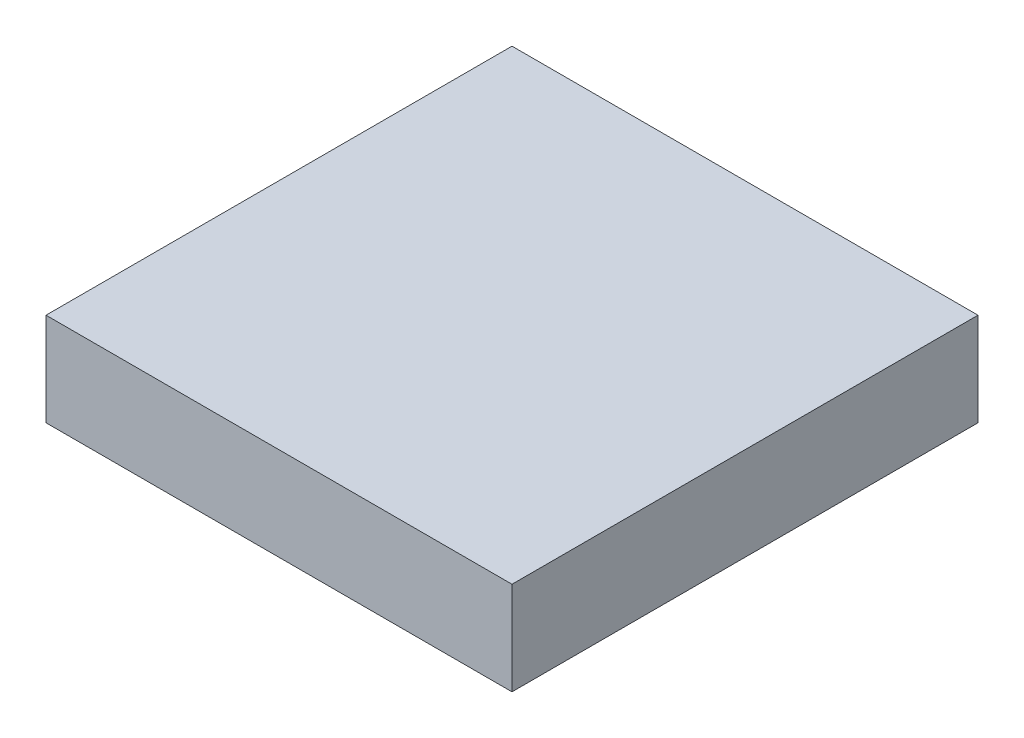
ISO-10303-21;
HEADER;
FILE_DESCRIPTION(('STEP AP214'),'2;1');
FILE_NAME('part.step','',(''),(''),'','','');
FILE_SCHEMA(('AUTOMOTIVE_DESIGN { 1 0 10303 214 1 1 1 1 }'));
ENDSEC;
DATA;
#1=APPLICATION_CONTEXT('core data for automotive mechanical design processes');
#2=APPLICATION_PROTOCOL_DEFINITION('international standard','automotive_design',2000,#1);
#3=PRODUCT_CONTEXT('',#1,'mechanical');
#4=PRODUCT('Part','Part','',(#3));
#5=PRODUCT_RELATED_PRODUCT_CATEGORY('part','',(#4));
#6=PRODUCT_DEFINITION_FORMATION('','',#4);
#7=PRODUCT_DEFINITION_CONTEXT('part definition',#1,'design');
#8=PRODUCT_DEFINITION('design','',#6,#7);
#9=PRODUCT_DEFINITION_SHAPE('','',#8);
#10=(LENGTH_UNIT() NAMED_UNIT(*) SI_UNIT(.MILLI.,.METRE.));
#11=(NAMED_UNIT(*) PLANE_ANGLE_UNIT() SI_UNIT($,.RADIAN.));
#12=(NAMED_UNIT(*) SI_UNIT($,.STERADIAN.) SOLID_ANGLE_UNIT());
#13=UNCERTAINTY_MEASURE_WITH_UNIT(LENGTH_MEASURE(1.E-05),#10,'distance_accuracy_value','');
#14=(GEOMETRIC_REPRESENTATION_CONTEXT(3) GLOBAL_UNCERTAINTY_ASSIGNED_CONTEXT((#13)) GLOBAL_UNIT_ASSIGNED_CONTEXT((#10,
#11,#12)) REPRESENTATION_CONTEXT('',''));
#15=CARTESIAN_POINT('',(0.,0.,0.));
#16=DIRECTION('',(0.,0.,1.));
#17=DIRECTION('',(1.,0.,0.));
#18=AXIS2_PLACEMENT_3D('',#15,#16,#17);
#19=CARTESIAN_POINT('',(-1.,0.4,-1.));
#20=DIRECTION('',(1.,0.,0.));
#21=DIRECTION('',(0.,0.,-1.));
#22=AXIS2_PLACEMENT_3D('',#19,#20,#21);
#23=PLANE('',#22);
#24=DIRECTION('',(0.,0.,1.));
#25=VECTOR('',#24,1.);
#26=CARTESIAN_POINT('',(-1.,0.,-1.));
#27=LINE('',#26,#25);
#28=CARTESIAN_POINT('',(-1.,0.,-1.));
#29=VERTEX_POINT('',#28);
#30=CARTESIAN_POINT('',(-1.,0.,1.));
#31=VERTEX_POINT('',#30);
#32=EDGE_CURVE('E99',#29,#31,#27,.T.);
#33=ORIENTED_EDGE('',*,*,#32,.T.);
#34=DIRECTION('',(0.,-1.,0.));
#35=VECTOR('',#34,1.);
#36=CARTESIAN_POINT('',(-1.,0.4,1.));
#37=LINE('',#36,#35);
#38=CARTESIAN_POINT('',(-1.,0.4,1.));
#39=VERTEX_POINT('',#38);
#40=EDGE_CURVE('E11',#39,#31,#37,.T.);
#41=ORIENTED_EDGE('',*,*,#40,.F.);
#42=DIRECTION('',(0.,0.,1.));
#43=VECTOR('',#42,1.);
#44=CARTESIAN_POINT('',(-1.,0.4,-1.));
#45=LINE('',#44,#43);
#46=CARTESIAN_POINT('',(-1.,0.4,-1.));
#47=VERTEX_POINT('',#46);
#48=EDGE_CURVE('E87',#47,#39,#45,.T.);
#49=ORIENTED_EDGE('',*,*,#48,.F.);
#50=DIRECTION('',(0.,-1.,0.));
#51=VECTOR('',#50,1.);
#52=CARTESIAN_POINT('',(-1.,0.4,-1.));
#53=LINE('',#52,#51);
#54=EDGE_CURVE('E95',#47,#29,#53,.T.);
#55=ORIENTED_EDGE('',*,*,#54,.T.);
#56=EDGE_LOOP('',(#33,#41,#49,#55));
#57=FACE_BOUND('',#56,.T.);
#58=ADVANCED_FACE('F36',(#57),#23,.F.);
#59=CARTESIAN_POINT('',(-1.,0.4,1.));
#60=DIRECTION('',(0.,0.,-1.));
#61=DIRECTION('',(-1.,0.,0.));
#62=AXIS2_PLACEMENT_3D('',#59,#60,#61);
#63=PLANE('',#62);
#64=DIRECTION('',(1.,0.,0.));
#65=VECTOR('',#64,1.);
#66=CARTESIAN_POINT('',(-1.,0.,1.));
#67=LINE('',#66,#65);
#68=CARTESIAN_POINT('',(1.,0.,1.));
#69=VERTEX_POINT('',#68);
#70=EDGE_CURVE('E91',#31,#69,#67,.T.);
#71=ORIENTED_EDGE('',*,*,#70,.T.);
#72=DIRECTION('',(0.,-1.,0.));
#73=VECTOR('',#72,1.);
#74=CARTESIAN_POINT('',(1.,0.4,1.));
#75=LINE('',#74,#73);
#76=CARTESIAN_POINT('',(1.,0.4,1.));
#77=VERTEX_POINT('',#76);
#78=EDGE_CURVE('E44',#77,#69,#75,.T.);
#79=ORIENTED_EDGE('',*,*,#78,.F.);
#80=DIRECTION('',(1.,0.,0.));
#81=VECTOR('',#80,1.);
#82=CARTESIAN_POINT('',(-1.,0.4,1.));
#83=LINE('',#82,#81);
#84=EDGE_CURVE('E82',#39,#77,#83,.T.);
#85=ORIENTED_EDGE('',*,*,#84,.F.);
#86=ORIENTED_EDGE('',*,*,#40,.T.);
#87=EDGE_LOOP('',(#71,#79,#85,#86));
#88=FACE_BOUND('',#87,.T.);
#89=ADVANCED_FACE('F90',(#88),#63,.F.);
#90=CARTESIAN_POINT('',(1.,0.4,-1.));
#91=DIRECTION('',(-1.,0.,0.));
#92=DIRECTION('',(0.,0.,1.));
#93=AXIS2_PLACEMENT_3D('',#90,#91,#92);
#94=PLANE('',#93);
#95=DIRECTION('',(0.,0.,-1.));
#96=VECTOR('',#95,1.);
#97=CARTESIAN_POINT('',(1.,0.,-1.));
#98=LINE('',#97,#96);
#99=CARTESIAN_POINT('',(1.,0.,-1.));
#100=VERTEX_POINT('',#99);
#101=EDGE_CURVE('E69',#69,#100,#98,.T.);
#102=ORIENTED_EDGE('',*,*,#101,.T.);
#103=DIRECTION('',(0.,-1.,0.));
#104=VECTOR('',#103,1.);
#105=CARTESIAN_POINT('',(1.,0.4,-1.));
#106=LINE('',#105,#104);
#107=CARTESIAN_POINT('',(1.,0.4,-1.));
#108=VERTEX_POINT('',#107);
#109=EDGE_CURVE('E92',#108,#100,#106,.T.);
#110=ORIENTED_EDGE('',*,*,#109,.F.);
#111=DIRECTION('',(0.,0.,-1.));
#112=VECTOR('',#111,1.);
#113=CARTESIAN_POINT('',(1.,0.4,-1.));
#114=LINE('',#113,#112);
#115=EDGE_CURVE('E85',#77,#108,#114,.T.);
#116=ORIENTED_EDGE('',*,*,#115,.F.);
#117=ORIENTED_EDGE('',*,*,#78,.T.);
#118=EDGE_LOOP('',(#102,#110,#116,#117));
#119=FACE_BOUND('',#118,.T.);
#120=ADVANCED_FACE('F93',(#119),#94,.F.);
#121=CARTESIAN_POINT('',(-1.,0.4,-1.));
#122=DIRECTION('',(0.,0.,1.));
#123=DIRECTION('',(1.,0.,0.));
#124=AXIS2_PLACEMENT_3D('',#121,#122,#123);
#125=PLANE('',#124);
#126=DIRECTION('',(-1.,0.,0.));
#127=VECTOR('',#126,1.);
#128=CARTESIAN_POINT('',(-1.,0.,-1.));
#129=LINE('',#128,#127);
#130=EDGE_CURVE('E75',#100,#29,#129,.T.);
#131=ORIENTED_EDGE('',*,*,#130,.T.);
#132=ORIENTED_EDGE('',*,*,#54,.F.);
#133=DIRECTION('',(-1.,0.,0.));
#134=VECTOR('',#133,1.);
#135=CARTESIAN_POINT('',(-1.,0.4,-1.));
#136=LINE('',#135,#134);
#137=EDGE_CURVE('E52',#108,#47,#136,.T.);
#138=ORIENTED_EDGE('',*,*,#137,.F.);
#139=ORIENTED_EDGE('',*,*,#109,.T.);
#140=EDGE_LOOP('',(#131,#132,#138,#139));
#141=FACE_BOUND('',#140,.T.);
#142=ADVANCED_FACE('F106',(#141),#125,.F.);
#143=CARTESIAN_POINT('',(0.,0.4,0.));
#144=DIRECTION('',(0.,1.,0.));
#145=DIRECTION('',(0.,0.,1.));
#146=AXIS2_PLACEMENT_3D('',#143,#144,#145);
#147=PLANE('',#146);
#148=ORIENTED_EDGE('',*,*,#48,.T.);
#149=ORIENTED_EDGE('',*,*,#84,.T.);
#150=ORIENTED_EDGE('',*,*,#115,.T.);
#151=ORIENTED_EDGE('',*,*,#137,.T.);
#152=EDGE_LOOP('',(#148,#149,#150,#151));
#153=FACE_BOUND('',#152,.T.);
#154=ADVANCED_FACE('F83',(#153),#147,.T.);
#155=CARTESIAN_POINT('',(0.,0.,0.));
#156=DIRECTION('',(0.,1.,0.));
#157=DIRECTION('',(0.,0.,1.));
#158=AXIS2_PLACEMENT_3D('',#155,#156,#157);
#159=PLANE('',#158);
#160=ORIENTED_EDGE('',*,*,#32,.F.);
#161=ORIENTED_EDGE('',*,*,#130,.F.);
#162=ORIENTED_EDGE('',*,*,#101,.F.);
#163=ORIENTED_EDGE('',*,*,#70,.F.);
#164=EDGE_LOOP('',(#160,#161,#162,#163));
#165=FACE_BOUND('',#164,.T.);
#166=ADVANCED_FACE('F109',(#165),#159,.F.);
#167=CLOSED_SHELL('',(#58,#89,#120,#142,#154,#166));
#168=MANIFOLD_SOLID_BREP('B2',#167);
#169=ADVANCED_BREP_SHAPE_REPRESENTATION('',(#18,#168),#14);
#170=SHAPE_DEFINITION_REPRESENTATION(#9,#169);
ENDSEC;
END-ISO-10303-21;
